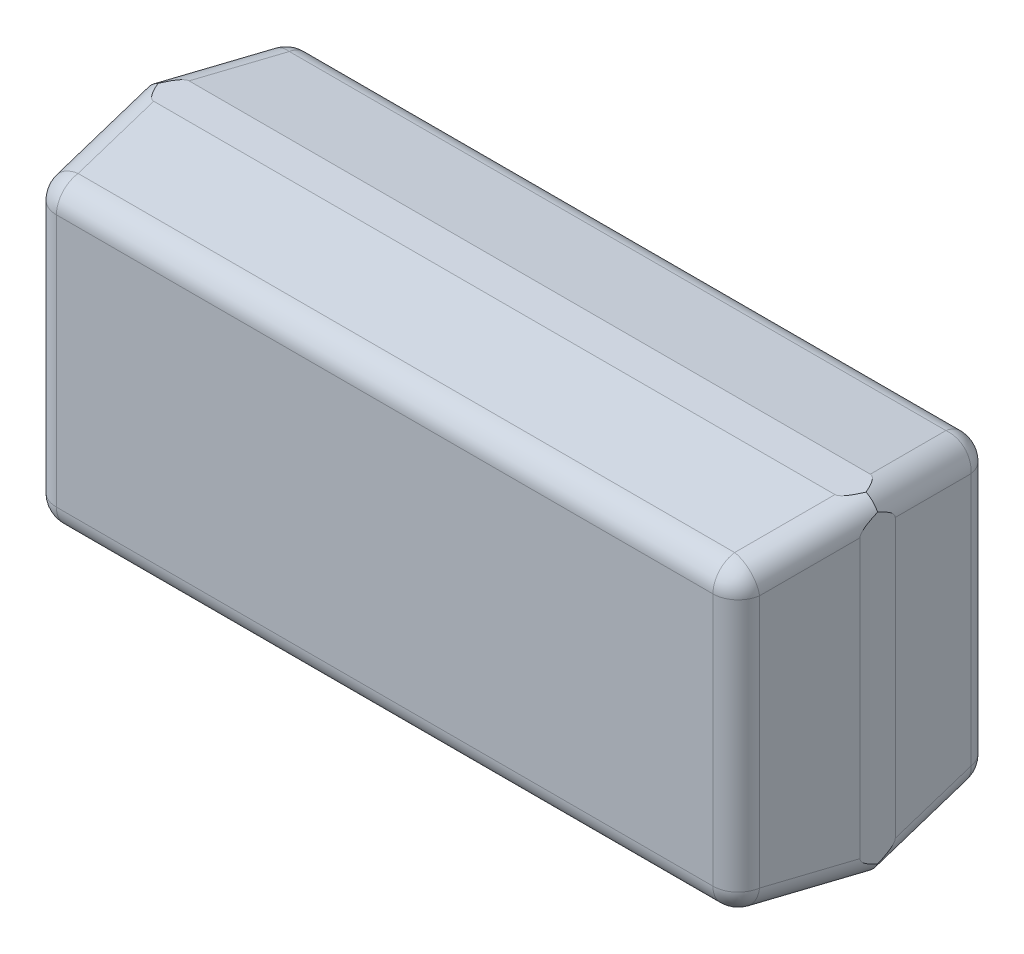
ISO-10303-21;
HEADER;
FILE_DESCRIPTION(('STEP AP214'),'2;1');
FILE_NAME('part.step','',(''),(''),'','','');
FILE_SCHEMA(('AUTOMOTIVE_DESIGN { 1 0 10303 214 1 1 1 1 }'));
ENDSEC;
DATA;
#1=APPLICATION_CONTEXT('core data for automotive mechanical design processes');
#2=APPLICATION_PROTOCOL_DEFINITION('international standard','automotive_design',2000,#1);
#3=PRODUCT_CONTEXT('',#1,'mechanical');
#4=PRODUCT('Part','Part','',(#3));
#5=PRODUCT_RELATED_PRODUCT_CATEGORY('part','',(#4));
#6=PRODUCT_DEFINITION_FORMATION('','',#4);
#7=PRODUCT_DEFINITION_CONTEXT('part definition',#1,'design');
#8=PRODUCT_DEFINITION('design','',#6,#7);
#9=PRODUCT_DEFINITION_SHAPE('','',#8);
#10=(LENGTH_UNIT() NAMED_UNIT(*) SI_UNIT(.MILLI.,.METRE.));
#11=(NAMED_UNIT(*) PLANE_ANGLE_UNIT() SI_UNIT($,.RADIAN.));
#12=(NAMED_UNIT(*) SI_UNIT($,.STERADIAN.) SOLID_ANGLE_UNIT());
#13=UNCERTAINTY_MEASURE_WITH_UNIT(LENGTH_MEASURE(1.E-05),#10,'distance_accuracy_value','');
#14=(GEOMETRIC_REPRESENTATION_CONTEXT(3) GLOBAL_UNCERTAINTY_ASSIGNED_CONTEXT((#13)) GLOBAL_UNIT_ASSIGNED_CONTEXT((#10,
#11,#12)) REPRESENTATION_CONTEXT('',''));
#15=CARTESIAN_POINT('',(0.,0.,0.));
#16=DIRECTION('',(0.,0.,1.));
#17=DIRECTION('',(1.,0.,0.));
#18=AXIS2_PLACEMENT_3D('',#15,#16,#17);
#19=CARTESIAN_POINT('',(1.306717051564,0.506717051564,0.875981499606));
#20=DIRECTION('',(-0.137844537491893,-0.137844537491893,0.980814848463915));
#21=DIRECTION('',(0.69354083043729,0.69354083043729,0.194941614420081));
#22=AXIS2_PLACEMENT_3D('',#19,#20,#21);
#23=CYLINDRICAL_SURFACE('',#22,0.1);
#24=CARTESIAN_POINT('',(1.301936063123,0.501936063123,0.91));
#25=DIRECTION('',(-0.137844537491893,-0.137844537491893,0.980814848463915));
#26=DIRECTION('',(0.69354083043729,0.69354083043729,0.194941614420081));
#27=AXIS2_PLACEMENT_3D('',#24,#25,#26);
#28=CIRCLE('',#27,0.1);
#29=CARTESIAN_POINT('',(1.400962869997,0.501936063123,0.923917310096));
#30=VERTEX_POINT('',#29);
#31=CARTESIAN_POINT('',(1.301936063123,0.600962869997,0.923917310096));
#32=VERTEX_POINT('',#31);
#33=EDGE_CURVE('E263',#30,#32,#28,.T.);
#34=ORIENTED_EDGE('',*,*,#33,.F.);
#35=DIRECTION('',(0.137844537491984,0.137844537491984,-0.980814848463889));
#36=VECTOR('',#35,1.);
#37=CARTESIAN_POINT('',(1.405743858438,0.506717051564,0.889898809702));
#38=LINE('',#37,#36);
#39=CARTESIAN_POINT('',(1.45,0.550973193126,0.575));
#40=VERTEX_POINT('',#39);
#41=EDGE_CURVE('E257',#30,#40,#38,.T.);
#42=ORIENTED_EDGE('',*,*,#41,.T.);
#43=CARTESIAN_POINT('',(1.45,0.65,-0.143529653433));
#44=DIRECTION('',(-1.,0.,0.));
#45=DIRECTION('',(0.,-0.139173100959942,0.990268068741588));
#46=AXIS2_PLACEMENT_3D('',#43,#44,#45);
#47=ELLIPSE('',#46,0.725454935101,0.1);
#48=CARTESIAN_POINT('',(1.45,0.60408790876,0.505));
#49=VERTEX_POINT('',#48);
#50=EDGE_CURVE('E27',#40,#49,#47,.T.);
#51=ORIENTED_EDGE('',*,*,#50,.T.);
#52=CARTESIAN_POINT('',(1.358855101177,0.558855101177,0.505));
#53=DIRECTION('',(0.,0.,-1.));
#54=DIRECTION('',(0.707106781186548,0.707106781186548,0.));
#55=AXIS2_PLACEMENT_3D('',#52,#53,#54);
#56=ELLIPSE('',#55,0.101956042118,0.1);
#57=CARTESIAN_POINT('',(1.40408790876,0.65,0.505));
#58=VERTEX_POINT('',#57);
#59=EDGE_CURVE('E11',#58,#49,#56,.T.);
#60=ORIENTED_EDGE('',*,*,#59,.F.);
#61=CARTESIAN_POINT('',(1.45,0.65,-0.143529653433));
#62=DIRECTION('',(0.,-1.,0.));
#63=DIRECTION('',(-0.139173100959942,0.,0.990268068741588));
#64=AXIS2_PLACEMENT_3D('',#61,#62,#63);
#65=ELLIPSE('',#64,0.725454935101,0.1);
#66=CARTESIAN_POINT('',(1.350973193126,0.65,0.575));
#67=VERTEX_POINT('',#66);
#68=EDGE_CURVE('E292',#58,#67,#65,.T.);
#69=ORIENTED_EDGE('',*,*,#68,.T.);
#70=DIRECTION('',(-0.137844537491984,-0.137844537491984,0.980814848463889));
#71=VECTOR('',#70,1.);
#72=CARTESIAN_POINT('',(1.306717051564,0.605743858438,0.889898809702));
#73=LINE('',#72,#71);
#74=EDGE_CURVE('E442',#67,#32,#73,.T.);
#75=ORIENTED_EDGE('',*,*,#74,.T.);
#76=EDGE_LOOP('',(#34,#42,#51,#60,#69,#75));
#77=FACE_BOUND('',#76,.T.);
#78=ADVANCED_FACE('F16',(#77),#23,.T.);
#79=CARTESIAN_POINT('',(1.306717051564,0.506717051564,0.134018500394));
#80=DIRECTION('',(-0.137844537491893,-0.137844537491893,-0.980814848463915));
#81=DIRECTION('',(0.69354083043729,0.69354083043729,-0.194941614420081));
#82=AXIS2_PLACEMENT_3D('',#79,#80,#81);
#83=CYLINDRICAL_SURFACE('',#82,0.1);
#84=CARTESIAN_POINT('',(1.301936063123,0.501936063123,0.1));
#85=DIRECTION('',(-0.137844537491893,-0.137844537491893,-0.980814848463915));
#86=DIRECTION('',(0.69354083043729,0.69354083043729,-0.194941614420081));
#87=AXIS2_PLACEMENT_3D('',#84,#85,#86);
#88=CIRCLE('',#87,0.1);
#89=CARTESIAN_POINT('',(1.301936063123,0.600962869997,0.08608268990399));
#90=VERTEX_POINT('',#89);
#91=CARTESIAN_POINT('',(1.400962869997,0.501936063123,0.08608268990399));
#92=VERTEX_POINT('',#91);
#93=EDGE_CURVE('E367',#90,#92,#88,.T.);
#94=ORIENTED_EDGE('',*,*,#93,.F.);
#95=DIRECTION('',(0.137844537491984,0.137844537491984,0.980814848463889));
#96=VECTOR('',#95,1.);
#97=CARTESIAN_POINT('',(1.306717051564,0.605743858438,0.120101190298));
#98=LINE('',#97,#96);
#99=CARTESIAN_POINT('',(1.350973193126,0.65,0.435));
#100=VERTEX_POINT('',#99);
#101=EDGE_CURVE('E436',#90,#100,#98,.T.);
#102=ORIENTED_EDGE('',*,*,#101,.T.);
#103=CARTESIAN_POINT('',(1.45,0.65,1.153529653433));
#104=DIRECTION('',(0.,-1.,0.));
#105=DIRECTION('',(-0.139173100959942,0.,-0.990268068741588));
#106=AXIS2_PLACEMENT_3D('',#103,#104,#105);
#107=ELLIPSE('',#106,0.725454935101,0.1);
#108=EDGE_CURVE('E296',#100,#58,#107,.T.);
#109=ORIENTED_EDGE('',*,*,#108,.T.);
#110=ORIENTED_EDGE('',*,*,#59,.T.);
#111=CARTESIAN_POINT('',(1.45,0.65,1.153529653433));
#112=DIRECTION('',(-1.,0.,0.));
#113=DIRECTION('',(0.,-0.139173100959942,-0.990268068741588));
#114=AXIS2_PLACEMENT_3D('',#111,#112,#113);
#115=ELLIPSE('',#114,0.725454935101,0.1);
#116=CARTESIAN_POINT('',(1.45,0.550973193126,0.435));
#117=VERTEX_POINT('',#116);
#118=EDGE_CURVE('E300',#49,#117,#115,.T.);
#119=ORIENTED_EDGE('',*,*,#118,.T.);
#120=DIRECTION('',(-0.137844537491984,-0.137844537491984,-0.980814848463889));
#121=VECTOR('',#120,1.);
#122=CARTESIAN_POINT('',(1.405743858438,0.506717051564,0.120101190298));
#123=LINE('',#122,#121);
#124=EDGE_CURVE('E291',#117,#92,#123,.T.);
#125=ORIENTED_EDGE('',*,*,#124,.T.);
#126=EDGE_LOOP('',(#94,#102,#109,#110,#119,#125));
#127=FACE_BOUND('',#126,.T.);
#128=ADVANCED_FACE('F566',(#127),#83,.T.);
#129=CARTESIAN_POINT('',(1.45,-0.65,0.));
#130=DIRECTION('',(1.,0.,0.));
#131=DIRECTION('',(0.,1.,0.));
#132=AXIS2_PLACEMENT_3D('',#129,#130,#131);
#133=PLANE('',#132);
#134=CARTESIAN_POINT('',(1.45,-0.65,-0.143529653433));
#135=DIRECTION('',(-1.,0.,0.));
#136=DIRECTION('',(0.,0.139173100959942,0.990268068741588));
#137=AXIS2_PLACEMENT_3D('',#134,#135,#136);
#138=ELLIPSE('',#137,0.725454935101,0.1);
#139=CARTESIAN_POINT('',(1.45,-0.60408790876,0.505));
#140=VERTEX_POINT('',#139);
#141=CARTESIAN_POINT('',(1.45,-0.550973193126,0.575));
#142=VERTEX_POINT('',#141);
#143=EDGE_CURVE('E233',#140,#142,#138,.T.);
#144=ORIENTED_EDGE('',*,*,#143,.F.);
#145=CARTESIAN_POINT('',(1.45,-0.65,1.153529653433));
#146=DIRECTION('',(-1.,0.,0.));
#147=DIRECTION('',(0.,0.139173100959942,-0.990268068741588));
#148=AXIS2_PLACEMENT_3D('',#145,#146,#147);
#149=ELLIPSE('',#148,0.725454935101,0.1);
#150=CARTESIAN_POINT('',(1.45,-0.550973193126,0.435));
#151=VERTEX_POINT('',#150);
#152=EDGE_CURVE('E288',#151,#140,#149,.T.);
#153=ORIENTED_EDGE('',*,*,#152,.F.);
#154=DIRECTION('',(0.,-1.,0.));
#155=VECTOR('',#154,1.);
#156=CARTESIAN_POINT('',(1.45,-0.325,0.435));
#157=LINE('',#156,#155);
#158=EDGE_CURVE('E336',#117,#151,#157,.T.);
#159=ORIENTED_EDGE('',*,*,#158,.F.);
#160=ORIENTED_EDGE('',*,*,#118,.F.);
#161=ORIENTED_EDGE('',*,*,#50,.F.);
#162=DIRECTION('',(0.,1.,0.));
#163=VECTOR('',#162,1.);
#164=CARTESIAN_POINT('',(1.45,-0.325,0.575));
#165=LINE('',#164,#163);
#166=EDGE_CURVE('E382',#142,#40,#165,.T.);
#167=ORIENTED_EDGE('',*,*,#166,.F.);
#168=EDGE_LOOP('',(#144,#153,#159,#160,#161,#167));
#169=FACE_BOUND('',#168,.T.);
#170=ADVANCED_FACE('F577',(#169),#133,.T.);
#171=CARTESIAN_POINT('',(1.419432368452,-0.325,0.7925));
#172=DIRECTION('',(0.990268068741588,0.,0.139173100959942));
#173=DIRECTION('',(0.,-1.,0.));
#174=AXIS2_PLACEMENT_3D('',#171,#172,#173);
#175=PLANE('',#174);
#176=DIRECTION('',(0.,1.,0.));
#177=VECTOR('',#176,1.);
#178=CARTESIAN_POINT('',(1.400962869997,-0.1625,0.923917310096));
#179=LINE('',#178,#177);
#180=CARTESIAN_POINT('',(1.400962869997,-0.501936063123,0.923917310096));
#181=VERTEX_POINT('',#180);
#182=EDGE_CURVE('E254',#181,#30,#179,.T.);
#183=ORIENTED_EDGE('',*,*,#182,.F.);
#184=DIRECTION('',(-0.137844537491984,0.137844537491984,0.980814848463889));
#185=VECTOR('',#184,1.);
#186=CARTESIAN_POINT('',(1.398143411831,-0.499116604957,0.943978797362));
#187=LINE('',#186,#185);
#188=EDGE_CURVE('E226',#142,#181,#187,.T.);
#189=ORIENTED_EDGE('',*,*,#188,.F.);
#190=ORIENTED_EDGE('',*,*,#166,.T.);
#191=ORIENTED_EDGE('',*,*,#41,.F.);
#192=EDGE_LOOP('',(#183,#189,#190,#191));
#193=FACE_BOUND('',#192,.T.);
#194=ADVANCED_FACE('F255',(#193),#175,.T.);
#195=CARTESIAN_POINT('',(-1.45,-0.65,0.));
#196=DIRECTION('',(0.,-1.,0.));
#197=DIRECTION('',(0.,0.,-1.));
#198=AXIS2_PLACEMENT_3D('',#195,#196,#197);
#199=PLANE('',#198);
#200=CARTESIAN_POINT('',(-1.45,-0.65,1.153529653433));
#201=DIRECTION('',(0.,1.,0.));
#202=DIRECTION('',(0.139173100959942,0.,-0.990268068741588));
#203=AXIS2_PLACEMENT_3D('',#200,#201,#202);
#204=ELLIPSE('',#203,0.725454935101,0.1);
#205=CARTESIAN_POINT('',(-1.350973193126,-0.65,0.435));
#206=VERTEX_POINT('',#205);
#207=CARTESIAN_POINT('',(-1.40408790876,-0.65,0.505));
#208=VERTEX_POINT('',#207);
#209=EDGE_CURVE('E366',#206,#208,#204,.T.);
#210=ORIENTED_EDGE('',*,*,#209,.F.);
#211=DIRECTION('',(-1.,0.,0.));
#212=VECTOR('',#211,1.);
#213=CARTESIAN_POINT('',(-0.725,-0.65,0.435));
#214=LINE('',#213,#212);
#215=CARTESIAN_POINT('',(1.350973193126,-0.65,0.435));
#216=VERTEX_POINT('',#215);
#217=EDGE_CURVE('E325',#216,#206,#214,.T.);
#218=ORIENTED_EDGE('',*,*,#217,.F.);
#219=CARTESIAN_POINT('',(1.45,-0.65,1.153529653433));
#220=DIRECTION('',(0.,1.,0.));
#221=DIRECTION('',(-0.139173100959942,0.,-0.990268068741588));
#222=AXIS2_PLACEMENT_3D('',#219,#220,#221);
#223=ELLIPSE('',#222,0.725454935101,0.1);
#224=CARTESIAN_POINT('',(1.40408790876,-0.65,0.505));
#225=VERTEX_POINT('',#224);
#226=EDGE_CURVE('E287',#225,#216,#223,.T.);
#227=ORIENTED_EDGE('',*,*,#226,.F.);
#228=CARTESIAN_POINT('',(1.45,-0.65,-0.143529653433));
#229=DIRECTION('',(0.,1.,0.));
#230=DIRECTION('',(-0.139173100959942,0.,0.990268068741588));
#231=AXIS2_PLACEMENT_3D('',#228,#229,#230);
#232=ELLIPSE('',#231,0.725454935101,0.1);
#233=CARTESIAN_POINT('',(1.350973193126,-0.65,0.575));
#234=VERTEX_POINT('',#233);
#235=EDGE_CURVE('E396',#234,#225,#232,.T.);
#236=ORIENTED_EDGE('',*,*,#235,.F.);
#237=DIRECTION('',(1.,0.,0.));
#238=VECTOR('',#237,1.);
#239=CARTESIAN_POINT('',(-0.725,-0.65,0.575));
#240=LINE('',#239,#238);
#241=CARTESIAN_POINT('',(-1.350973193126,-0.65,0.575));
#242=VERTEX_POINT('',#241);
#243=EDGE_CURVE('E413',#242,#234,#240,.T.);
#244=ORIENTED_EDGE('',*,*,#243,.F.);
#245=CARTESIAN_POINT('',(-1.45,-0.65,-0.143529653433));
#246=DIRECTION('',(0.,1.,0.));
#247=DIRECTION('',(0.139173100959942,0.,0.990268068741588));
#248=AXIS2_PLACEMENT_3D('',#245,#246,#247);
#249=ELLIPSE('',#248,0.725454935101,0.1);
#250=EDGE_CURVE('E355',#208,#242,#249,.T.);
#251=ORIENTED_EDGE('',*,*,#250,.F.);
#252=EDGE_LOOP('',(#210,#218,#227,#236,#244,#251));
#253=FACE_BOUND('',#252,.T.);
#254=ADVANCED_FACE('F456',(#253),#199,.T.);
#255=CARTESIAN_POINT('',(0.725,0.619432368452,0.7925));
#256=DIRECTION('',(0.,0.990268068741588,0.139173100959942));
#257=DIRECTION('',(1.,0.,0.));
#258=AXIS2_PLACEMENT_3D('',#255,#256,#257);
#259=PLANE('',#258);
#260=DIRECTION('',(-1.,0.,0.));
#261=VECTOR('',#260,1.);
#262=CARTESIAN_POINT('',(0.3625,0.600962869997,0.923917310096));
#263=LINE('',#262,#261);
#264=CARTESIAN_POINT('',(-1.301936063123,0.600962869997,0.923917310096));
#265=VERTEX_POINT('',#264);
#266=EDGE_CURVE('E330',#32,#265,#263,.T.);
#267=ORIENTED_EDGE('',*,*,#266,.F.);
#268=ORIENTED_EDGE('',*,*,#74,.F.);
#269=DIRECTION('',(-1.,0.,0.));
#270=VECTOR('',#269,1.);
#271=CARTESIAN_POINT('',(0.725,0.65,0.575));
#272=LINE('',#271,#270);
#273=CARTESIAN_POINT('',(-1.350973193126,0.65,0.575));
#274=VERTEX_POINT('',#273);
#275=EDGE_CURVE('E297',#67,#274,#272,.T.);
#276=ORIENTED_EDGE('',*,*,#275,.T.);
#277=DIRECTION('',(-0.137844537491984,0.137844537491984,-0.980814848463889));
#278=VECTOR('',#277,1.);
#279=CARTESIAN_POINT('',(-1.299116604957,0.598143411831,0.943978797362));
#280=LINE('',#279,#278);
#281=EDGE_CURVE('E360',#265,#274,#280,.T.);
#282=ORIENTED_EDGE('',*,*,#281,.F.);
#283=EDGE_LOOP('',(#267,#268,#276,#282));
#284=FACE_BOUND('',#283,.T.);
#285=ADVANCED_FACE('F622',(#284),#259,.T.);
#286=CARTESIAN_POINT('',(1.45,0.65,0.));
#287=DIRECTION('',(0.,1.,0.));
#288=DIRECTION('',(1.,0.,0.));
#289=AXIS2_PLACEMENT_3D('',#286,#287,#288);
#290=PLANE('',#289);
#291=CARTESIAN_POINT('',(-1.45,0.65,1.153529653433));
#292=DIRECTION('',(0.,-1.,0.));
#293=DIRECTION('',(0.139173100959942,0.,-0.990268068741588));
#294=AXIS2_PLACEMENT_3D('',#291,#292,#293);
#295=ELLIPSE('',#294,0.725454935101,0.1);
#296=CARTESIAN_POINT('',(-1.40408790876,0.65,0.505));
#297=VERTEX_POINT('',#296);
#298=CARTESIAN_POINT('',(-1.350973193126,0.65,0.435));
#299=VERTEX_POINT('',#298);
#300=EDGE_CURVE('E361',#297,#299,#295,.T.);
#301=ORIENTED_EDGE('',*,*,#300,.F.);
#302=CARTESIAN_POINT('',(-1.45,0.65,-0.143529653433));
#303=DIRECTION('',(0.,-1.,0.));
#304=DIRECTION('',(0.139173100959942,0.,0.990268068741588));
#305=AXIS2_PLACEMENT_3D('',#302,#303,#304);
#306=ELLIPSE('',#305,0.725454935101,0.1);
#307=EDGE_CURVE('E371',#274,#297,#306,.T.);
#308=ORIENTED_EDGE('',*,*,#307,.F.);
#309=ORIENTED_EDGE('',*,*,#275,.F.);
#310=ORIENTED_EDGE('',*,*,#68,.F.);
#311=ORIENTED_EDGE('',*,*,#108,.F.);
#312=DIRECTION('',(1.,0.,0.));
#313=VECTOR('',#312,1.);
#314=CARTESIAN_POINT('',(0.725,0.65,0.435));
#315=LINE('',#314,#313);
#316=EDGE_CURVE('E378',#299,#100,#315,.T.);
#317=ORIENTED_EDGE('',*,*,#316,.F.);
#318=EDGE_LOOP('',(#301,#308,#309,#310,#311,#317));
#319=FACE_BOUND('',#318,.T.);
#320=ADVANCED_FACE('F570',(#319),#290,.T.);
#321=CARTESIAN_POINT('',(0.725,0.619432368452,0.2175));
#322=DIRECTION('',(0.,0.990268068741588,-0.139173100959942));
#323=DIRECTION('',(-1.,0.,0.));
#324=AXIS2_PLACEMENT_3D('',#321,#322,#323);
#325=PLANE('',#324);
#326=DIRECTION('',(1.,0.,0.));
#327=VECTOR('',#326,1.);
#328=CARTESIAN_POINT('',(0.3625,0.600962869997,0.08608268990399));
#329=LINE('',#328,#327);
#330=CARTESIAN_POINT('',(-1.301936063123,0.600962869997,0.08608268990399));
#331=VERTEX_POINT('',#330);
#332=EDGE_CURVE('E488',#331,#90,#329,.T.);
#333=ORIENTED_EDGE('',*,*,#332,.F.);
#334=DIRECTION('',(0.137844537491984,-0.137844537491984,-0.980814848463889));
#335=VECTOR('',#334,1.);
#336=CARTESIAN_POINT('',(-1.299116604957,0.598143411831,0.06602120263754));
#337=LINE('',#336,#335);
#338=EDGE_CURVE('E357',#299,#331,#337,.T.);
#339=ORIENTED_EDGE('',*,*,#338,.F.);
#340=ORIENTED_EDGE('',*,*,#316,.T.);
#341=ORIENTED_EDGE('',*,*,#101,.F.);
#342=EDGE_LOOP('',(#333,#339,#340,#341));
#343=FACE_BOUND('',#342,.T.);
#344=ADVANCED_FACE('F612',(#343),#325,.T.);
#345=CARTESIAN_POINT('',(-1.419432368452,0.325,0.2175));
#346=DIRECTION('',(-0.990268068741588,0.,-0.139173100959942));
#347=DIRECTION('',(-0.139173100959942,0.,0.990268068741588));
#348=AXIS2_PLACEMENT_3D('',#345,#346,#347);
#349=PLANE('',#348);
#350=DIRECTION('',(0.,1.,0.));
#351=VECTOR('',#350,1.);
#352=CARTESIAN_POINT('',(-1.400962869997,0.1625,0.08608268990399));
#353=LINE('',#352,#351);
#354=CARTESIAN_POINT('',(-1.400962869997,-0.501936063123,0.08608268990399));
#355=VERTEX_POINT('',#354);
#356=CARTESIAN_POINT('',(-1.400962869997,0.501936063123,0.08608268990399));
#357=VERTEX_POINT('',#356);
#358=EDGE_CURVE('E388',#355,#357,#353,.T.);
#359=ORIENTED_EDGE('',*,*,#358,.F.);
#360=DIRECTION('',(0.137844537491984,0.137844537491984,-0.980814848463889));
#361=VECTOR('',#360,1.);
#362=CARTESIAN_POINT('',(-1.405743858438,-0.506717051564,0.120101190298));
#363=LINE('',#362,#361);
#364=CARTESIAN_POINT('',(-1.45,-0.550973193126,0.435));
#365=VERTEX_POINT('',#364);
#366=EDGE_CURVE('E281',#365,#355,#363,.T.);
#367=ORIENTED_EDGE('',*,*,#366,.F.);
#368=DIRECTION('',(0.,1.,0.));
#369=VECTOR('',#368,1.);
#370=CARTESIAN_POINT('',(-1.45,0.325,0.435));
#371=LINE('',#370,#369);
#372=CARTESIAN_POINT('',(-1.45,0.550973193126,0.435));
#373=VERTEX_POINT('',#372);
#374=EDGE_CURVE('E375',#365,#373,#371,.T.);
#375=ORIENTED_EDGE('',*,*,#374,.T.);
#376=DIRECTION('',(-0.137844537491984,0.137844537491984,0.980814848463889));
#377=VECTOR('',#376,1.);
#378=CARTESIAN_POINT('',(-1.398143411831,0.499116604957,0.06602120263754));
#379=LINE('',#378,#377);
#380=EDGE_CURVE('E317',#357,#373,#379,.T.);
#381=ORIENTED_EDGE('',*,*,#380,.F.);
#382=EDGE_LOOP('',(#359,#367,#375,#381));
#383=FACE_BOUND('',#382,.T.);
#384=ADVANCED_FACE('F821',(#383),#349,.T.);
#385=CARTESIAN_POINT('',(-1.45,0.65,0.));
#386=DIRECTION('',(-1.,0.,0.));
#387=DIRECTION('',(0.,0.,1.));
#388=AXIS2_PLACEMENT_3D('',#385,#386,#387);
#389=PLANE('',#388);
#390=CARTESIAN_POINT('',(-1.45,0.65,1.153529653433));
#391=DIRECTION('',(1.,0.,0.));
#392=DIRECTION('',(0.,-0.139173100959942,-0.990268068741588));
#393=AXIS2_PLACEMENT_3D('',#390,#391,#392);
#394=ELLIPSE('',#393,0.725454935101,0.1);
#395=CARTESIAN_POINT('',(-1.45,0.60408790876,0.505));
#396=VERTEX_POINT('',#395);
#397=EDGE_CURVE('E312',#373,#396,#394,.T.);
#398=ORIENTED_EDGE('',*,*,#397,.F.);
#399=ORIENTED_EDGE('',*,*,#374,.F.);
#400=CARTESIAN_POINT('',(-1.45,-0.65,1.153529653433));
#401=DIRECTION('',(1.,0.,0.));
#402=DIRECTION('',(0.,0.139173100959942,-0.990268068741588));
#403=AXIS2_PLACEMENT_3D('',#400,#401,#402);
#404=ELLIPSE('',#403,0.725454935101,0.1);
#405=CARTESIAN_POINT('',(-1.45,-0.60408790876,0.505));
#406=VERTEX_POINT('',#405);
#407=EDGE_CURVE('E278',#406,#365,#404,.T.);
#408=ORIENTED_EDGE('',*,*,#407,.F.);
#409=CARTESIAN_POINT('',(-1.45,-0.65,-0.143529653433));
#410=DIRECTION('',(1.,0.,0.));
#411=DIRECTION('',(0.,0.139173100959942,0.990268068741588));
#412=AXIS2_PLACEMENT_3D('',#409,#410,#411);
#413=ELLIPSE('',#412,0.725454935101,0.1);
#414=CARTESIAN_POINT('',(-1.45,-0.550973193126,0.575));
#415=VERTEX_POINT('',#414);
#416=EDGE_CURVE('E352',#415,#406,#413,.T.);
#417=ORIENTED_EDGE('',*,*,#416,.F.);
#418=DIRECTION('',(0.,-1.,0.));
#419=VECTOR('',#418,1.);
#420=CARTESIAN_POINT('',(-1.45,0.325,0.575));
#421=LINE('',#420,#419);
#422=CARTESIAN_POINT('',(-1.45,0.550973193126,0.575));
#423=VERTEX_POINT('',#422);
#424=EDGE_CURVE('E425',#423,#415,#421,.T.);
#425=ORIENTED_EDGE('',*,*,#424,.F.);
#426=CARTESIAN_POINT('',(-1.45,0.65,-0.143529653433));
#427=DIRECTION('',(1.,0.,0.));
#428=DIRECTION('',(0.,-0.139173100959942,0.990268068741588));
#429=AXIS2_PLACEMENT_3D('',#426,#427,#428);
#430=ELLIPSE('',#429,0.725454935101,0.1);
#431=EDGE_CURVE('E379',#396,#423,#430,.T.);
#432=ORIENTED_EDGE('',*,*,#431,.F.);
#433=EDGE_LOOP('',(#398,#399,#408,#417,#425,#432));
#434=FACE_BOUND('',#433,.T.);
#435=ADVANCED_FACE('F18',(#434),#389,.T.);
#436=CARTESIAN_POINT('',(-1.299116604957,0.499116604957,0.930061487266));
#437=DIRECTION('',(0.137844537491893,-0.137844537491893,0.980814848463915));
#438=DIRECTION('',(-0.69354083043729,0.69354083043729,0.194941614420081));
#439=AXIS2_PLACEMENT_3D('',#436,#437,#438);
#440=CYLINDRICAL_SURFACE('',#439,0.1);
#441=CARTESIAN_POINT('',(-1.301936063123,0.501936063123,0.91));
#442=DIRECTION('',(0.137844537491893,-0.137844537491893,0.980814848463915));
#443=DIRECTION('',(-0.69354083043729,0.69354083043729,0.194941614420081));
#444=AXIS2_PLACEMENT_3D('',#441,#442,#443);
#445=CIRCLE('',#444,0.1);
#446=CARTESIAN_POINT('',(-1.400962869997,0.501936063123,0.923917310096));
#447=VERTEX_POINT('',#446);
#448=EDGE_CURVE('E430',#265,#447,#445,.T.);
#449=ORIENTED_EDGE('',*,*,#448,.F.);
#450=ORIENTED_EDGE('',*,*,#281,.T.);
#451=ORIENTED_EDGE('',*,*,#307,.T.);
#452=CARTESIAN_POINT('',(-1.358855101177,0.558855101177,0.505));
#453=DIRECTION('',(0.,0.,-1.));
#454=DIRECTION('',(-0.707106781186548,0.707106781186548,0.));
#455=AXIS2_PLACEMENT_3D('',#452,#453,#454);
#456=ELLIPSE('',#455,0.101956042118,0.1);
#457=EDGE_CURVE('E316',#396,#297,#456,.T.);
#458=ORIENTED_EDGE('',*,*,#457,.F.);
#459=ORIENTED_EDGE('',*,*,#431,.T.);
#460=DIRECTION('',(0.137844537491984,-0.137844537491984,0.980814848463889));
#461=VECTOR('',#460,1.);
#462=CARTESIAN_POINT('',(-1.398143411831,0.499116604957,0.943978797362));
#463=LINE('',#462,#461);
#464=EDGE_CURVE('E419',#423,#447,#463,.T.);
#465=ORIENTED_EDGE('',*,*,#464,.T.);
#466=EDGE_LOOP('',(#449,#450,#451,#458,#459,#465));
#467=FACE_BOUND('',#466,.T.);
#468=ADVANCED_FACE('F617',(#467),#440,.T.);
#469=CARTESIAN_POINT('',(-1.299116604957,0.499116604957,0.07993851273355));
#470=DIRECTION('',(-0.137844537491893,0.137844537491893,0.980814848463915));
#471=DIRECTION('',(-0.69354083043729,0.69354083043729,-0.194941614420081));
#472=AXIS2_PLACEMENT_3D('',#469,#470,#471);
#473=CYLINDRICAL_SURFACE('',#472,0.1);
#474=CARTESIAN_POINT('',(-1.301936063123,0.501936063123,0.1));
#475=DIRECTION('',(0.137844537491893,-0.137844537491893,-0.980814848463915));
#476=DIRECTION('',(-0.69354083043729,0.69354083043729,-0.194941614420081));
#477=AXIS2_PLACEMENT_3D('',#474,#475,#476);
#478=CIRCLE('',#477,0.1);
#479=EDGE_CURVE('E392',#357,#331,#478,.T.);
#480=ORIENTED_EDGE('',*,*,#479,.F.);
#481=ORIENTED_EDGE('',*,*,#380,.T.);
#482=ORIENTED_EDGE('',*,*,#397,.T.);
#483=ORIENTED_EDGE('',*,*,#457,.T.);
#484=ORIENTED_EDGE('',*,*,#300,.T.);
#485=ORIENTED_EDGE('',*,*,#338,.T.);
#486=EDGE_LOOP('',(#480,#481,#482,#483,#484,#485));
#487=FACE_BOUND('',#486,.T.);
#488=ADVANCED_FACE('F611',(#487),#473,.T.);
#489=CARTESIAN_POINT('',(0.,0.,1.01));
#490=DIRECTION('',(0.,0.,1.));
#491=DIRECTION('',(1.,0.,0.));
#492=AXIS2_PLACEMENT_3D('',#489,#490,#491);
#493=PLANE('',#492);
#494=DIRECTION('',(1.,0.,0.));
#495=VECTOR('',#494,1.);
#496=CARTESIAN_POINT('',(0.3625,0.501936063123,1.01));
#497=LINE('',#496,#495);
#498=CARTESIAN_POINT('',(-1.301936063123,0.501936063123,1.01));
#499=VERTEX_POINT('',#498);
#500=CARTESIAN_POINT('',(1.301936063123,0.501936063123,1.01));
#501=VERTEX_POINT('',#500);
#502=EDGE_CURVE('E331',#499,#501,#497,.T.);
#503=ORIENTED_EDGE('',*,*,#502,.F.);
#504=DIRECTION('',(0.,1.,0.));
#505=VECTOR('',#504,1.);
#506=CARTESIAN_POINT('',(-1.301936063123,0.1625,1.01));
#507=LINE('',#506,#505);
#508=CARTESIAN_POINT('',(-1.301936063123,-0.501936063123,1.01));
#509=VERTEX_POINT('',#508);
#510=EDGE_CURVE('E307',#509,#499,#507,.T.);
#511=ORIENTED_EDGE('',*,*,#510,.F.);
#512=DIRECTION('',(-1.,0.,0.));
#513=VECTOR('',#512,1.);
#514=CARTESIAN_POINT('',(-0.3625,-0.501936063123,1.01));
#515=LINE('',#514,#513);
#516=CARTESIAN_POINT('',(1.301936063123,-0.501936063123,1.01));
#517=VERTEX_POINT('',#516);
#518=EDGE_CURVE('E345',#517,#509,#515,.T.);
#519=ORIENTED_EDGE('',*,*,#518,.F.);
#520=DIRECTION('',(0.,-1.,0.));
#521=VECTOR('',#520,1.);
#522=CARTESIAN_POINT('',(1.301936063123,-0.1625,1.01));
#523=LINE('',#522,#521);
#524=EDGE_CURVE('E266',#501,#517,#523,.T.);
#525=ORIENTED_EDGE('',*,*,#524,.F.);
#526=EDGE_LOOP('',(#503,#511,#519,#525));
#527=FACE_BOUND('',#526,.T.);
#528=ADVANCED_FACE('F793',(#527),#493,.T.);
#529=CARTESIAN_POINT('',(-1.419432368452,0.325,0.7925));
#530=DIRECTION('',(-0.990268068741588,0.,0.139173100959942));
#531=DIRECTION('',(0.,1.,0.));
#532=AXIS2_PLACEMENT_3D('',#529,#530,#531);
#533=PLANE('',#532);
#534=DIRECTION('',(0.,-1.,0.));
#535=VECTOR('',#534,1.);
#536=CARTESIAN_POINT('',(-1.400962869997,0.1625,0.923917310096));
#537=LINE('',#536,#535);
#538=CARTESIAN_POINT('',(-1.400962869997,-0.501936063123,0.923917310096));
#539=VERTEX_POINT('',#538);
#540=EDGE_CURVE('E431',#447,#539,#537,.T.);
#541=ORIENTED_EDGE('',*,*,#540,.F.);
#542=ORIENTED_EDGE('',*,*,#464,.F.);
#543=ORIENTED_EDGE('',*,*,#424,.T.);
#544=DIRECTION('',(-0.137844537491984,-0.137844537491984,-0.980814848463889));
#545=VECTOR('',#544,1.);
#546=CARTESIAN_POINT('',(-1.405743858438,-0.506717051564,0.889898809702));
#547=LINE('',#546,#545);
#548=EDGE_CURVE('E356',#539,#415,#547,.T.);
#549=ORIENTED_EDGE('',*,*,#548,.F.);
#550=EDGE_LOOP('',(#541,#542,#543,#549));
#551=FACE_BOUND('',#550,.T.);
#552=ADVANCED_FACE('F810',(#551),#533,.T.);
#553=CARTESIAN_POINT('',(-1.306717051564,-0.506717051564,0.875981499606));
#554=DIRECTION('',(0.137844537491893,0.137844537491893,0.980814848463915));
#555=DIRECTION('',(-0.69354083043729,-0.69354083043729,0.194941614420081));
#556=AXIS2_PLACEMENT_3D('',#553,#554,#555);
#557=CYLINDRICAL_SURFACE('',#556,0.1);
#558=CARTESIAN_POINT('',(-1.301936063123,-0.501936063123,0.91));
#559=DIRECTION('',(0.137844537491893,0.137844537491893,0.980814848463915));
#560=DIRECTION('',(-0.69354083043729,-0.69354083043729,0.194941614420081));
#561=AXIS2_PLACEMENT_3D('',#558,#559,#560);
#562=CIRCLE('',#561,0.1);
#563=CARTESIAN_POINT('',(-1.301936063123,-0.600962869997,0.923917310096));
#564=VERTEX_POINT('',#563);
#565=EDGE_CURVE('E426',#539,#564,#562,.T.);
#566=ORIENTED_EDGE('',*,*,#565,.F.);
#567=ORIENTED_EDGE('',*,*,#548,.T.);
#568=ORIENTED_EDGE('',*,*,#416,.T.);
#569=CARTESIAN_POINT('',(-1.358855101177,-0.558855101177,0.505));
#570=DIRECTION('',(0.,0.,-1.));
#571=DIRECTION('',(-0.707106781186548,-0.707106781186548,0.));
#572=AXIS2_PLACEMENT_3D('',#569,#570,#571);
#573=ELLIPSE('',#572,0.101956042118,0.1);
#574=EDGE_CURVE('E282',#208,#406,#573,.T.);
#575=ORIENTED_EDGE('',*,*,#574,.F.);
#576=ORIENTED_EDGE('',*,*,#250,.T.);
#577=DIRECTION('',(0.137844537491984,0.137844537491984,0.980814848463889));
#578=VECTOR('',#577,1.);
#579=CARTESIAN_POINT('',(-1.306717051564,-0.605743858438,0.889898809702));
#580=LINE('',#579,#578);
#581=EDGE_CURVE('E238',#242,#564,#580,.T.);
#582=ORIENTED_EDGE('',*,*,#581,.T.);
#583=EDGE_LOOP('',(#566,#567,#568,#575,#576,#582));
#584=FACE_BOUND('',#583,.T.);
#585=ADVANCED_FACE('F815',(#584),#557,.T.);
#586=CARTESIAN_POINT('',(-0.725,-0.619432368452,0.7925));
#587=DIRECTION('',(0.,-0.990268068741588,0.139173100959942));
#588=DIRECTION('',(-1.,0.,0.));
#589=AXIS2_PLACEMENT_3D('',#586,#587,#588);
#590=PLANE('',#589);
#591=DIRECTION('',(1.,0.,0.));
#592=VECTOR('',#591,1.);
#593=CARTESIAN_POINT('',(-0.3625,-0.600962869997,0.923917310096));
#594=LINE('',#593,#592);
#595=CARTESIAN_POINT('',(1.301936063123,-0.600962869997,0.923917310096));
#596=VERTEX_POINT('',#595);
#597=EDGE_CURVE('E251',#564,#596,#594,.T.);
#598=ORIENTED_EDGE('',*,*,#597,.F.);
#599=ORIENTED_EDGE('',*,*,#581,.F.);
#600=ORIENTED_EDGE('',*,*,#243,.T.);
#601=DIRECTION('',(0.137844537491984,-0.137844537491984,-0.980814848463889));
#602=VECTOR('',#601,1.);
#603=CARTESIAN_POINT('',(1.299116604957,-0.598143411831,0.943978797362));
#604=LINE('',#603,#602);
#605=EDGE_CURVE('E404',#596,#234,#604,.T.);
#606=ORIENTED_EDGE('',*,*,#605,.F.);
#607=EDGE_LOOP('',(#598,#599,#600,#606));
#608=FACE_BOUND('',#607,.T.);
#609=ADVANCED_FACE('F954',(#608),#590,.T.);
#610=CARTESIAN_POINT('',(1.299116604957,-0.499116604957,0.930061487266));
#611=DIRECTION('',(0.137844537491893,-0.137844537491893,-0.980814848463915));
#612=DIRECTION('',(0.69354083043729,-0.69354083043729,0.194941614420081));
#613=AXIS2_PLACEMENT_3D('',#610,#611,#612);
#614=CYLINDRICAL_SURFACE('',#613,0.1);
#615=CARTESIAN_POINT('',(1.301936063123,-0.501936063123,0.91));
#616=DIRECTION('',(-0.137844537491893,0.137844537491893,0.980814848463915));
#617=DIRECTION('',(0.69354083043729,-0.69354083043729,0.194941614420081));
#618=AXIS2_PLACEMENT_3D('',#615,#616,#617);
#619=CIRCLE('',#618,0.1);
#620=EDGE_CURVE('E230',#596,#181,#619,.T.);
#621=ORIENTED_EDGE('',*,*,#620,.F.);
#622=ORIENTED_EDGE('',*,*,#605,.T.);
#623=ORIENTED_EDGE('',*,*,#235,.T.);
#624=CARTESIAN_POINT('',(1.358855101177,-0.558855101177,0.505));
#625=DIRECTION('',(0.,0.,1.));
#626=DIRECTION('',(0.707106781186548,-0.707106781186548,0.));
#627=AXIS2_PLACEMENT_3D('',#624,#625,#626);
#628=ELLIPSE('',#627,0.101956042118,0.1);
#629=EDGE_CURVE('E284',#225,#140,#628,.T.);
#630=ORIENTED_EDGE('',*,*,#629,.T.);
#631=ORIENTED_EDGE('',*,*,#143,.T.);
#632=ORIENTED_EDGE('',*,*,#188,.T.);
#633=EDGE_LOOP('',(#621,#622,#623,#630,#631,#632));
#634=FACE_BOUND('',#633,.T.);
#635=ADVANCED_FACE('F228',(#634),#614,.T.);
#636=CARTESIAN_POINT('',(-1.301936063123,0.501936063123,0.91));
#637=DIRECTION('',(-0.319823861567067,-0.852793270944179,0.412863578685087));
#638=DIRECTION('',(-0.522248635260983,0.522248635260983,0.674175589839978));
#639=AXIS2_PLACEMENT_3D('',#636,#637,#638);
#640=SPHERICAL_SURFACE('',#639,0.1);
#641=CARTESIAN_POINT('',(-1.301936063123,0.501936063123,0.91));
#642=DIRECTION('',(1.,0.,0.));
#643=DIRECTION('',(0.,0.990268068741588,0.139173100959942));
#644=AXIS2_PLACEMENT_3D('',#641,#642,#643);
#645=CIRCLE('',#644,0.1);
#646=EDGE_CURVE('E332',#265,#499,#645,.T.);
#647=ORIENTED_EDGE('',*,*,#646,.F.);
#648=ORIENTED_EDGE('',*,*,#448,.T.);
#649=CARTESIAN_POINT('',(-1.301936063123,0.501936063123,0.91));
#650=DIRECTION('',(0.,-1.,0.));
#651=DIRECTION('',(0.,0.,1.));
#652=AXIS2_PLACEMENT_3D('',#649,#650,#651);
#653=CIRCLE('',#652,0.1);
#654=EDGE_CURVE('E311',#499,#447,#653,.T.);
#655=ORIENTED_EDGE('',*,*,#654,.F.);
#656=EDGE_LOOP('',(#647,#648,#655));
#657=FACE_BOUND('',#656,.T.);
#658=ADVANCED_FACE('F933',(#657),#640,.T.);
#659=CARTESIAN_POINT('',(-1.301936063123,-0.501936063123,0.91));
#660=DIRECTION('',(0.319823861567067,-0.852793270944179,-0.412863578685087));
#661=DIRECTION('',(-0.522248635260983,-0.522248635260983,0.674175589839978));
#662=AXIS2_PLACEMENT_3D('',#659,#660,#661);
#663=SPHERICAL_SURFACE('',#662,0.1);
#664=CARTESIAN_POINT('',(-1.301936063123,-0.501936063123,0.91));
#665=DIRECTION('',(0.,1.,0.));
#666=DIRECTION('',(-0.990268068741588,0.,0.139173100959942));
#667=AXIS2_PLACEMENT_3D('',#664,#665,#666);
#668=CIRCLE('',#667,0.1);
#669=EDGE_CURVE('E250',#539,#509,#668,.T.);
#670=ORIENTED_EDGE('',*,*,#669,.F.);
#671=ORIENTED_EDGE('',*,*,#565,.T.);
#672=CARTESIAN_POINT('',(-1.301936063123,-0.501936063123,0.91));
#673=DIRECTION('',(1.,0.,0.));
#674=DIRECTION('',(0.,0.,1.));
#675=AXIS2_PLACEMENT_3D('',#672,#673,#674);
#676=CIRCLE('',#675,0.1);
#677=EDGE_CURVE('E346',#509,#564,#676,.T.);
#678=ORIENTED_EDGE('',*,*,#677,.F.);
#679=EDGE_LOOP('',(#670,#671,#678));
#680=FACE_BOUND('',#679,.T.);
#681=ADVANCED_FACE('F938',(#680),#663,.T.);
#682=CARTESIAN_POINT('',(-1.301936063123,0.1625,0.91));
#683=DIRECTION('',(0.,1.,0.));
#684=DIRECTION('',(-0.656059028990675,0.,0.754709580222626));
#685=AXIS2_PLACEMENT_3D('',#682,#683,#684);
#686=CYLINDRICAL_SURFACE('',#685,0.1);
#687=ORIENTED_EDGE('',*,*,#669,.T.);
#688=ORIENTED_EDGE('',*,*,#510,.T.);
#689=ORIENTED_EDGE('',*,*,#654,.T.);
#690=ORIENTED_EDGE('',*,*,#540,.T.);
#691=EDGE_LOOP('',(#687,#688,#689,#690));
#692=FACE_BOUND('',#691,.T.);
#693=ADVANCED_FACE('F948',(#692),#686,.T.);
#694=CARTESIAN_POINT('',(1.301936063123,-0.501936063123,0.91));
#695=DIRECTION('',(-0.319823861567067,-0.852793270944179,-0.412863578685087));
#696=DIRECTION('',(0.522248635260983,-0.522248635260983,0.674175589839978));
#697=AXIS2_PLACEMENT_3D('',#694,#695,#696);
#698=SPHERICAL_SURFACE('',#697,0.1);
#699=CARTESIAN_POINT('',(1.301936063123,-0.501936063123,0.91));
#700=DIRECTION('',(-1.,0.,0.));
#701=DIRECTION('',(0.,-0.990268068741588,0.139173100959942));
#702=AXIS2_PLACEMENT_3D('',#699,#700,#701);
#703=CIRCLE('',#702,0.1);
#704=EDGE_CURVE('E248',#596,#517,#703,.T.);
#705=ORIENTED_EDGE('',*,*,#704,.F.);
#706=ORIENTED_EDGE('',*,*,#620,.T.);
#707=CARTESIAN_POINT('',(1.301936063123,-0.501936063123,0.91));
#708=DIRECTION('',(0.,1.,0.));
#709=DIRECTION('',(0.,0.,1.));
#710=AXIS2_PLACEMENT_3D('',#707,#708,#709);
#711=CIRCLE('',#710,0.1);
#712=EDGE_CURVE('E245',#517,#181,#711,.T.);
#713=ORIENTED_EDGE('',*,*,#712,.F.);
#714=EDGE_LOOP('',(#705,#706,#713));
#715=FACE_BOUND('',#714,.T.);
#716=ADVANCED_FACE('F243',(#715),#698,.T.);
#717=CARTESIAN_POINT('',(-0.3625,-0.501936063123,0.91));
#718=DIRECTION('',(-1.,0.,0.));
#719=DIRECTION('',(0.,-0.656059028990675,0.754709580222626));
#720=AXIS2_PLACEMENT_3D('',#717,#718,#719);
#721=CYLINDRICAL_SURFACE('',#720,0.1);
#722=ORIENTED_EDGE('',*,*,#704,.T.);
#723=ORIENTED_EDGE('',*,*,#518,.T.);
#724=ORIENTED_EDGE('',*,*,#677,.T.);
#725=ORIENTED_EDGE('',*,*,#597,.T.);
#726=EDGE_LOOP('',(#722,#723,#724,#725));
#727=FACE_BOUND('',#726,.T.);
#728=ADVANCED_FACE('F799',(#727),#721,.T.);
#729=CARTESIAN_POINT('',(1.301936063123,0.501936063123,0.91));
#730=DIRECTION('',(0.319823861567067,-0.852793270944179,0.412863578685087));
#731=DIRECTION('',(0.522248635260983,0.522248635260983,0.674175589839978));
#732=AXIS2_PLACEMENT_3D('',#729,#730,#731);
#733=SPHERICAL_SURFACE('',#732,0.1);
#734=CARTESIAN_POINT('',(1.301936063123,0.501936063123,0.91));
#735=DIRECTION('',(0.,-1.,0.));
#736=DIRECTION('',(0.990268068741588,0.,0.139173100959942));
#737=AXIS2_PLACEMENT_3D('',#734,#735,#736);
#738=CIRCLE('',#737,0.1);
#739=EDGE_CURVE('E273',#30,#501,#738,.T.);
#740=ORIENTED_EDGE('',*,*,#739,.F.);
#741=ORIENTED_EDGE('',*,*,#33,.T.);
#742=CARTESIAN_POINT('',(1.301936063123,0.501936063123,0.91));
#743=DIRECTION('',(-1.,0.,0.));
#744=DIRECTION('',(0.,0.,1.));
#745=AXIS2_PLACEMENT_3D('',#742,#743,#744);
#746=CIRCLE('',#745,0.1);
#747=EDGE_CURVE('E326',#501,#32,#746,.T.);
#748=ORIENTED_EDGE('',*,*,#747,.F.);
#749=EDGE_LOOP('',(#740,#741,#748));
#750=FACE_BOUND('',#749,.T.);
#751=ADVANCED_FACE('F629',(#750),#733,.T.);
#752=CARTESIAN_POINT('',(1.301936063123,-0.1625,0.91));
#753=DIRECTION('',(0.,-1.,0.));
#754=DIRECTION('',(0.656059028990675,0.,0.754709580222626));
#755=AXIS2_PLACEMENT_3D('',#752,#753,#754);
#756=CYLINDRICAL_SURFACE('',#755,0.1);
#757=ORIENTED_EDGE('',*,*,#739,.T.);
#758=ORIENTED_EDGE('',*,*,#524,.T.);
#759=ORIENTED_EDGE('',*,*,#712,.T.);
#760=ORIENTED_EDGE('',*,*,#182,.T.);
#761=EDGE_LOOP('',(#757,#758,#759,#760));
#762=FACE_BOUND('',#761,.T.);
#763=ADVANCED_FACE('F265',(#762),#756,.T.);
#764=CARTESIAN_POINT('',(0.3625,0.501936063123,0.91));
#765=DIRECTION('',(1.,0.,0.));
#766=DIRECTION('',(0.,0.656059028990675,0.754709580222626));
#767=AXIS2_PLACEMENT_3D('',#764,#765,#766);
#768=CYLINDRICAL_SURFACE('',#767,0.1);
#769=ORIENTED_EDGE('',*,*,#646,.T.);
#770=ORIENTED_EDGE('',*,*,#502,.T.);
#771=ORIENTED_EDGE('',*,*,#747,.T.);
#772=ORIENTED_EDGE('',*,*,#266,.T.);
#773=EDGE_LOOP('',(#769,#770,#771,#772));
#774=FACE_BOUND('',#773,.T.);
#775=ADVANCED_FACE('F626',(#774),#768,.T.);
#776=CARTESIAN_POINT('',(0.,0.,0.));
#777=DIRECTION('',(0.,0.,1.));
#778=DIRECTION('',(1.,0.,0.));
#779=AXIS2_PLACEMENT_3D('',#776,#777,#778);
#780=PLANE('',#779);
#781=DIRECTION('',(-1.,0.,0.));
#782=VECTOR('',#781,1.);
#783=CARTESIAN_POINT('',(0.3625,0.501936063123,0.));
#784=LINE('',#783,#782);
#785=CARTESIAN_POINT('',(1.301936063123,0.501936063123,0.));
#786=VERTEX_POINT('',#785);
#787=CARTESIAN_POINT('',(-1.301936063123,0.501936063123,0.));
#788=VERTEX_POINT('',#787);
#789=EDGE_CURVE('E401',#786,#788,#784,.T.);
#790=ORIENTED_EDGE('',*,*,#789,.F.);
#791=DIRECTION('',(0.,1.,0.));
#792=VECTOR('',#791,1.);
#793=CARTESIAN_POINT('',(1.301936063123,-0.1625,0.));
#794=LINE('',#793,#792);
#795=CARTESIAN_POINT('',(1.301936063123,-0.501936063123,0.));
#796=VERTEX_POINT('',#795);
#797=EDGE_CURVE('E301',#796,#786,#794,.T.);
#798=ORIENTED_EDGE('',*,*,#797,.F.);
#799=DIRECTION('',(1.,0.,0.));
#800=VECTOR('',#799,1.);
#801=CARTESIAN_POINT('',(-0.3625,-0.501936063123,0.));
#802=LINE('',#801,#800);
#803=CARTESIAN_POINT('',(-1.301936063123,-0.501936063123,0.));
#804=VERTEX_POINT('',#803);
#805=EDGE_CURVE('E478',#804,#796,#802,.T.);
#806=ORIENTED_EDGE('',*,*,#805,.F.);
#807=DIRECTION('',(0.,-1.,0.));
#808=VECTOR('',#807,1.);
#809=CARTESIAN_POINT('',(-1.301936063123,0.1625,0.));
#810=LINE('',#809,#808);
#811=EDGE_CURVE('E513',#788,#804,#810,.T.);
#812=ORIENTED_EDGE('',*,*,#811,.F.);
#813=EDGE_LOOP('',(#790,#798,#806,#812));
#814=FACE_BOUND('',#813,.T.);
#815=ADVANCED_FACE('F589',(#814),#780,.F.);
#816=CARTESIAN_POINT('',(1.419432368452,-0.325,0.2175));
#817=DIRECTION('',(0.990268068741588,0.,-0.139173100959942));
#818=DIRECTION('',(0.,-1.,0.));
#819=AXIS2_PLACEMENT_3D('',#816,#817,#818);
#820=PLANE('',#819);
#821=DIRECTION('',(0.,-1.,0.));
#822=VECTOR('',#821,1.);
#823=CARTESIAN_POINT('',(1.400962869997,-0.1625,0.08608268990399));
#824=LINE('',#823,#822);
#825=CARTESIAN_POINT('',(1.400962869997,-0.501936063123,0.08608268990399));
#826=VERTEX_POINT('',#825);
#827=EDGE_CURVE('E321',#92,#826,#824,.T.);
#828=ORIENTED_EDGE('',*,*,#827,.F.);
#829=ORIENTED_EDGE('',*,*,#124,.F.);
#830=ORIENTED_EDGE('',*,*,#158,.T.);
#831=DIRECTION('',(0.137844537491984,-0.137844537491984,0.980814848463889));
#832=VECTOR('',#831,1.);
#833=CARTESIAN_POINT('',(1.398143411831,-0.499116604957,0.06602120263754));
#834=LINE('',#833,#832);
#835=EDGE_CURVE('E340',#826,#151,#834,.T.);
#836=ORIENTED_EDGE('',*,*,#835,.F.);
#837=EDGE_LOOP('',(#828,#829,#830,#836));
#838=FACE_BOUND('',#837,.T.);
#839=ADVANCED_FACE('F585',(#838),#820,.T.);
#840=CARTESIAN_POINT('',(1.299116604957,-0.499116604957,0.07993851273355));
#841=DIRECTION('',(-0.137844537491893,0.137844537491893,-0.980814848463915));
#842=DIRECTION('',(0.69354083043729,-0.69354083043729,-0.194941614420081));
#843=AXIS2_PLACEMENT_3D('',#840,#841,#842);
#844=CYLINDRICAL_SURFACE('',#843,0.1);
#845=CARTESIAN_POINT('',(1.301936063123,-0.501936063123,0.1));
#846=DIRECTION('',(-0.137844537491893,0.137844537491893,-0.980814848463915));
#847=DIRECTION('',(0.69354083043729,-0.69354083043729,-0.194941614420081));
#848=AXIS2_PLACEMENT_3D('',#845,#846,#847);
#849=CIRCLE('',#848,0.1);
#850=CARTESIAN_POINT('',(1.301936063123,-0.600962869997,0.08608268990399));
#851=VERTEX_POINT('',#850);
#852=EDGE_CURVE('E495',#826,#851,#849,.T.);
#853=ORIENTED_EDGE('',*,*,#852,.F.);
#854=ORIENTED_EDGE('',*,*,#835,.T.);
#855=ORIENTED_EDGE('',*,*,#152,.T.);
#856=ORIENTED_EDGE('',*,*,#629,.F.);
#857=ORIENTED_EDGE('',*,*,#226,.T.);
#858=DIRECTION('',(-0.137844537491984,0.137844537491984,-0.980814848463889));
#859=VECTOR('',#858,1.);
#860=CARTESIAN_POINT('',(1.299116604957,-0.598143411831,0.06602120263754));
#861=LINE('',#860,#859);
#862=EDGE_CURVE('E322',#216,#851,#861,.T.);
#863=ORIENTED_EDGE('',*,*,#862,.T.);
#864=EDGE_LOOP('',(#853,#854,#855,#856,#857,#863));
#865=FACE_BOUND('',#864,.T.);
#866=ADVANCED_FACE('F887',(#865),#844,.T.);
#867=CARTESIAN_POINT('',(-0.725,-0.619432368452,0.2175));
#868=DIRECTION('',(0.,-0.990268068741588,-0.139173100959942));
#869=DIRECTION('',(0.,0.139173100959942,-0.990268068741588));
#870=AXIS2_PLACEMENT_3D('',#867,#868,#869);
#871=PLANE('',#870);
#872=DIRECTION('',(-1.,0.,0.));
#873=VECTOR('',#872,1.);
#874=CARTESIAN_POINT('',(-0.3625,-0.600962869997,0.08608268990399));
#875=LINE('',#874,#873);
#876=CARTESIAN_POINT('',(-1.301936063123,-0.600962869997,0.08608268990399));
#877=VERTEX_POINT('',#876);
#878=EDGE_CURVE('E409',#851,#877,#875,.T.);
#879=ORIENTED_EDGE('',*,*,#878,.F.);
#880=ORIENTED_EDGE('',*,*,#862,.F.);
#881=ORIENTED_EDGE('',*,*,#217,.T.);
#882=DIRECTION('',(-0.137844537491984,-0.137844537491984,0.980814848463889));
#883=VECTOR('',#882,1.);
#884=CARTESIAN_POINT('',(-1.306717051564,-0.605743858438,0.120101190298));
#885=LINE('',#884,#883);
#886=EDGE_CURVE('E362',#877,#206,#885,.T.);
#887=ORIENTED_EDGE('',*,*,#886,.F.);
#888=EDGE_LOOP('',(#879,#880,#881,#887));
#889=FACE_BOUND('',#888,.T.);
#890=ADVANCED_FACE('F452',(#889),#871,.T.);
#891=CARTESIAN_POINT('',(-1.306717051564,-0.506717051564,0.134018500394));
#892=DIRECTION('',(0.137844537491893,0.137844537491893,-0.980814848463915));
#893=DIRECTION('',(-0.69354083043729,-0.69354083043729,-0.194941614420081));
#894=AXIS2_PLACEMENT_3D('',#891,#892,#893);
#895=CYLINDRICAL_SURFACE('',#894,0.1);
#896=CARTESIAN_POINT('',(-1.301936063123,-0.501936063123,0.1));
#897=DIRECTION('',(0.137844537491893,0.137844537491893,-0.980814848463915));
#898=DIRECTION('',(-0.69354083043729,-0.69354083043729,-0.194941614420081));
#899=AXIS2_PLACEMENT_3D('',#896,#897,#898);
#900=CIRCLE('',#899,0.1);
#901=EDGE_CURVE('E405',#877,#355,#900,.T.);
#902=ORIENTED_EDGE('',*,*,#901,.F.);
#903=ORIENTED_EDGE('',*,*,#886,.T.);
#904=ORIENTED_EDGE('',*,*,#209,.T.);
#905=ORIENTED_EDGE('',*,*,#574,.T.);
#906=ORIENTED_EDGE('',*,*,#407,.T.);
#907=ORIENTED_EDGE('',*,*,#366,.T.);
#908=EDGE_LOOP('',(#902,#903,#904,#905,#906,#907));
#909=FACE_BOUND('',#908,.T.);
#910=ADVANCED_FACE('F461',(#909),#895,.T.);
#911=CARTESIAN_POINT('',(1.301936063123,0.501936063123,0.1));
#912=DIRECTION('',(0.319823861567067,-0.852793270944179,-0.412863578685087));
#913=DIRECTION('',(0.522248635260983,0.522248635260983,-0.674175589839978));
#914=AXIS2_PLACEMENT_3D('',#911,#912,#913);
#915=SPHERICAL_SURFACE('',#914,0.1);
#916=CARTESIAN_POINT('',(1.301936063123,0.501936063123,0.1));
#917=DIRECTION('',(-1.,0.,0.));
#918=DIRECTION('',(0.,0.990268068741588,-0.139173100959942));
#919=AXIS2_PLACEMENT_3D('',#916,#917,#918);
#920=CIRCLE('',#919,0.1);
#921=EDGE_CURVE('E397',#90,#786,#920,.T.);
#922=ORIENTED_EDGE('',*,*,#921,.F.);
#923=ORIENTED_EDGE('',*,*,#93,.T.);
#924=CARTESIAN_POINT('',(1.301936063123,0.501936063123,0.1));
#925=DIRECTION('',(0.,-1.,0.));
#926=DIRECTION('',(0.,0.,-1.));
#927=AXIS2_PLACEMENT_3D('',#924,#925,#926);
#928=CIRCLE('',#927,0.1);
#929=EDGE_CURVE('E305',#786,#92,#928,.T.);
#930=ORIENTED_EDGE('',*,*,#929,.F.);
#931=EDGE_LOOP('',(#922,#923,#930));
#932=FACE_BOUND('',#931,.T.);
#933=ADVANCED_FACE('F584',(#932),#915,.T.);
#934=CARTESIAN_POINT('',(1.301936063123,-0.501936063123,0.1));
#935=DIRECTION('',(-0.319823861567067,-0.852793270944179,0.412863578685087));
#936=DIRECTION('',(0.522248635260983,-0.522248635260983,-0.674175589839978));
#937=AXIS2_PLACEMENT_3D('',#934,#935,#936);
#938=SPHERICAL_SURFACE('',#937,0.1);
#939=CARTESIAN_POINT('',(1.301936063123,-0.501936063123,0.1));
#940=DIRECTION('',(0.,1.,0.));
#941=DIRECTION('',(0.990268068741588,0.,-0.139173100959942));
#942=AXIS2_PLACEMENT_3D('',#939,#940,#941);
#943=CIRCLE('',#942,0.1);
#944=EDGE_CURVE('E306',#826,#796,#943,.T.);
#945=ORIENTED_EDGE('',*,*,#944,.F.);
#946=ORIENTED_EDGE('',*,*,#852,.T.);
#947=CARTESIAN_POINT('',(1.301936063123,-0.501936063123,0.1));
#948=DIRECTION('',(-1.,0.,0.));
#949=DIRECTION('',(0.,0.,-1.));
#950=AXIS2_PLACEMENT_3D('',#947,#948,#949);
#951=CIRCLE('',#950,0.1);
#952=EDGE_CURVE('E20',#796,#851,#951,.T.);
#953=ORIENTED_EDGE('',*,*,#952,.F.);
#954=EDGE_LOOP('',(#945,#946,#953));
#955=FACE_BOUND('',#954,.T.);
#956=ADVANCED_FACE('F974',(#955),#938,.T.);
#957=CARTESIAN_POINT('',(1.301936063123,-0.1625,0.1));
#958=DIRECTION('',(0.,1.,0.));
#959=DIRECTION('',(0.656059028990675,0.,-0.754709580222626));
#960=AXIS2_PLACEMENT_3D('',#957,#958,#959);
#961=CYLINDRICAL_SURFACE('',#960,0.1);
#962=ORIENTED_EDGE('',*,*,#944,.T.);
#963=ORIENTED_EDGE('',*,*,#797,.T.);
#964=ORIENTED_EDGE('',*,*,#929,.T.);
#965=ORIENTED_EDGE('',*,*,#827,.T.);
#966=EDGE_LOOP('',(#962,#963,#964,#965));
#967=FACE_BOUND('',#966,.T.);
#968=ADVANCED_FACE('F586',(#967),#961,.T.);
#969=CARTESIAN_POINT('',(-1.301936063123,-0.501936063123,0.1));
#970=DIRECTION('',(0.319823861567067,-0.852793270944179,0.412863578685087));
#971=DIRECTION('',(-0.522248635260983,-0.522248635260983,-0.674175589839978));
#972=AXIS2_PLACEMENT_3D('',#969,#970,#971);
#973=SPHERICAL_SURFACE('',#972,0.1);
#974=CARTESIAN_POINT('',(-1.301936063123,-0.501936063123,0.1));
#975=DIRECTION('',(1.,0.,0.));
#976=DIRECTION('',(0.,-0.990268068741588,-0.139173100959942));
#977=AXIS2_PLACEMENT_3D('',#974,#975,#976);
#978=CIRCLE('',#977,0.1);
#979=EDGE_CURVE('E472',#877,#804,#978,.T.);
#980=ORIENTED_EDGE('',*,*,#979,.F.);
#981=ORIENTED_EDGE('',*,*,#901,.T.);
#982=CARTESIAN_POINT('',(-1.301936063123,-0.501936063123,0.1));
#983=DIRECTION('',(0.,1.,0.));
#984=DIRECTION('',(0.,0.,-1.));
#985=AXIS2_PLACEMENT_3D('',#982,#983,#984);
#986=CIRCLE('',#985,0.1);
#987=EDGE_CURVE('E393',#804,#355,#986,.T.);
#988=ORIENTED_EDGE('',*,*,#987,.F.);
#989=EDGE_LOOP('',(#980,#981,#988));
#990=FACE_BOUND('',#989,.T.);
#991=ADVANCED_FACE('F474',(#990),#973,.T.);
#992=CARTESIAN_POINT('',(-0.3625,-0.501936063123,0.1));
#993=DIRECTION('',(1.,0.,0.));
#994=DIRECTION('',(0.,-0.656059028990675,-0.754709580222626));
#995=AXIS2_PLACEMENT_3D('',#992,#993,#994);
#996=CYLINDRICAL_SURFACE('',#995,0.1);
#997=ORIENTED_EDGE('',*,*,#979,.T.);
#998=ORIENTED_EDGE('',*,*,#805,.T.);
#999=ORIENTED_EDGE('',*,*,#952,.T.);
#1000=ORIENTED_EDGE('',*,*,#878,.T.);
#1001=EDGE_LOOP('',(#997,#998,#999,#1000));
#1002=FACE_BOUND('',#1001,.T.);
#1003=ADVANCED_FACE('F470',(#1002),#996,.T.);
#1004=CARTESIAN_POINT('',(-1.301936063123,0.501936063123,0.1));
#1005=DIRECTION('',(-0.319823861567067,-0.852793270944179,-0.412863578685087));
#1006=DIRECTION('',(-0.522248635260983,0.522248635260983,-0.674175589839978));
#1007=AXIS2_PLACEMENT_3D('',#1004,#1005,#1006);
#1008=SPHERICAL_SURFACE('',#1007,0.1);
#1009=CARTESIAN_POINT('',(-1.301936063123,0.501936063123,0.1));
#1010=DIRECTION('',(0.,-1.,0.));
#1011=DIRECTION('',(-0.990268068741588,0.,-0.139173100959942));
#1012=AXIS2_PLACEMENT_3D('',#1009,#1010,#1011);
#1013=CIRCLE('',#1012,0.1);
#1014=EDGE_CURVE('E516',#357,#788,#1013,.T.);
#1015=ORIENTED_EDGE('',*,*,#1014,.F.);
#1016=ORIENTED_EDGE('',*,*,#479,.T.);
#1017=CARTESIAN_POINT('',(-1.301936063123,0.501936063123,0.1));
#1018=DIRECTION('',(1.,0.,0.));
#1019=DIRECTION('',(0.,0.,-1.));
#1020=AXIS2_PLACEMENT_3D('',#1017,#1018,#1019);
#1021=CIRCLE('',#1020,0.1);
#1022=EDGE_CURVE('E502',#788,#331,#1021,.T.);
#1023=ORIENTED_EDGE('',*,*,#1022,.F.);
#1024=EDGE_LOOP('',(#1015,#1016,#1023));
#1025=FACE_BOUND('',#1024,.T.);
#1026=ADVANCED_FACE('F607',(#1025),#1008,.T.);
#1027=CARTESIAN_POINT('',(-1.301936063123,0.1625,0.1));
#1028=DIRECTION('',(0.,-1.,0.));
#1029=DIRECTION('',(-0.656059028990675,0.,-0.754709580222626));
#1030=AXIS2_PLACEMENT_3D('',#1027,#1028,#1029);
#1031=CYLINDRICAL_SURFACE('',#1030,0.1);
#1032=ORIENTED_EDGE('',*,*,#1014,.T.);
#1033=ORIENTED_EDGE('',*,*,#811,.T.);
#1034=ORIENTED_EDGE('',*,*,#987,.T.);
#1035=ORIENTED_EDGE('',*,*,#358,.T.);
#1036=EDGE_LOOP('',(#1032,#1033,#1034,#1035));
#1037=FACE_BOUND('',#1036,.T.);
#1038=ADVANCED_FACE('F605',(#1037),#1031,.T.);
#1039=CARTESIAN_POINT('',(0.3625,0.501936063123,0.1));
#1040=DIRECTION('',(-1.,0.,0.));
#1041=DIRECTION('',(0.,0.656059028990675,-0.754709580222626));
#1042=AXIS2_PLACEMENT_3D('',#1039,#1040,#1041);
#1043=CYLINDRICAL_SURFACE('',#1042,0.1);
#1044=ORIENTED_EDGE('',*,*,#921,.T.);
#1045=ORIENTED_EDGE('',*,*,#789,.T.);
#1046=ORIENTED_EDGE('',*,*,#1022,.T.);
#1047=ORIENTED_EDGE('',*,*,#332,.T.);
#1048=EDGE_LOOP('',(#1044,#1045,#1046,#1047));
#1049=FACE_BOUND('',#1048,.T.);
#1050=ADVANCED_FACE('F592',(#1049),#1043,.T.);
#1051=CLOSED_SHELL('',(#78,#128,#170,#194,#254,#285,#320,#344,#384,#435,#468,#488,#528,#552,
#585,#609,#635,#658,#681,#693,#716,#728,#751,#763,#775,#815,#839,#866,#890,#910,#933,#956,#968,
#991,#1003,#1026,#1038,#1050));
#1052=MANIFOLD_SOLID_BREP('B1',#1051);
#1053=ADVANCED_BREP_SHAPE_REPRESENTATION('',(#18,#1052),#14);
#1054=SHAPE_DEFINITION_REPRESENTATION(#9,#1053);
ENDSEC;
END-ISO-10303-21;
